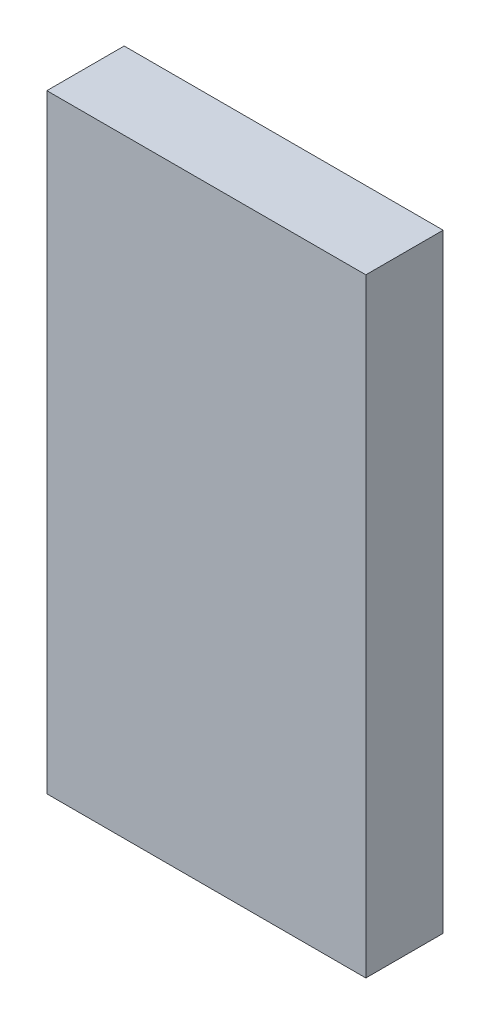
ISO-10303-21;
HEADER;
FILE_DESCRIPTION(('STEP AP214'),'2;1');
FILE_NAME('part.step','',(''),(''),'','','');
FILE_SCHEMA(('AUTOMOTIVE_DESIGN { 1 0 10303 214 1 1 1 1 }'));
ENDSEC;
DATA;
#1=APPLICATION_CONTEXT('core data for automotive mechanical design processes');
#2=APPLICATION_PROTOCOL_DEFINITION('international standard','automotive_design',2000,#1);
#3=PRODUCT_CONTEXT('',#1,'mechanical');
#4=PRODUCT('Part','Part','',(#3));
#5=PRODUCT_RELATED_PRODUCT_CATEGORY('part','',(#4));
#6=PRODUCT_DEFINITION_FORMATION('','',#4);
#7=PRODUCT_DEFINITION_CONTEXT('part definition',#1,'design');
#8=PRODUCT_DEFINITION('design','',#6,#7);
#9=PRODUCT_DEFINITION_SHAPE('','',#8);
#10=(LENGTH_UNIT() NAMED_UNIT(*) SI_UNIT(.MILLI.,.METRE.));
#11=(NAMED_UNIT(*) PLANE_ANGLE_UNIT() SI_UNIT($,.RADIAN.));
#12=(NAMED_UNIT(*) SI_UNIT($,.STERADIAN.) SOLID_ANGLE_UNIT());
#13=UNCERTAINTY_MEASURE_WITH_UNIT(LENGTH_MEASURE(1.E-05),#10,'distance_accuracy_value','');
#14=(GEOMETRIC_REPRESENTATION_CONTEXT(3) GLOBAL_UNCERTAINTY_ASSIGNED_CONTEXT((#13)) GLOBAL_UNIT_ASSIGNED_CONTEXT((#10,
#11,#12)) REPRESENTATION_CONTEXT('',''));
#15=CARTESIAN_POINT('',(0.,0.,0.));
#16=DIRECTION('',(0.,0.,1.));
#17=DIRECTION('',(1.,0.,0.));
#18=AXIS2_PLACEMENT_3D('',#15,#16,#17);
#19=CARTESIAN_POINT('',(-12.6027993894922,-13.7690277297927,1.03674100901396E-06));
#20=DIRECTION('',(0.,8.74227339409095E-08,-1.));
#21=DIRECTION('',(1.19248806384999E-08,1.,8.74227339409095E-08));
#22=AXIS2_PLACEMENT_3D('',#19,#20,#21);
#23=PLANE('',#22);
#24=DIRECTION('',(-1.19248807761764E-08,-1.,-8.74227339409095E-08));
#25=VECTOR('',#24,1.);
#26=CARTESIAN_POINT('',(-14.2527993894922,-13.7690277101167,1.03674101074869E-06));
#27=LINE('',#26,#25);
#28=CARTESIAN_POINT('',(-14.2527993519289,-10.6190277101167,1.3121226227937E-06));
#29=VERTEX_POINT('',#28);
#30=CARTESIAN_POINT('',(-14.2527994270556,-16.9190277101166,7.61359398703671E-07));
#31=VERTEX_POINT('',#30);
#32=EDGE_CURVE('E90',#29,#31,#27,.T.);
#33=ORIENTED_EDGE('',*,*,#32,.T.);
#34=DIRECTION('',(1.,-1.19248806384999E-08,0.));
#35=VECTOR('',#34,1.);
#36=CARTESIAN_POINT('',(-12.6027994270556,-16.9190277297927,7.61359396968947E-07));
#37=LINE('',#36,#35);
#38=CARTESIAN_POINT('',(-10.9527994270556,-16.9190277494687,7.61359395234224E-07));
#39=VERTEX_POINT('',#38);
#40=EDGE_CURVE('E27',#31,#39,#37,.T.);
#41=ORIENTED_EDGE('',*,*,#40,.T.);
#42=DIRECTION('',(-1.19248807761764E-08,-1.,-8.74227339409095E-08));
#43=VECTOR('',#42,1.);
#44=CARTESIAN_POINT('',(-10.9527993894922,-13.7690277494688,1.03674100727924E-06));
#45=LINE('',#44,#43);
#46=CARTESIAN_POINT('',(-10.9527993519289,-10.6190277494688,1.31212261932426E-06));
#47=VERTEX_POINT('',#46);
#48=EDGE_CURVE('E78',#47,#39,#45,.T.);
#49=ORIENTED_EDGE('',*,*,#48,.F.);
#50=DIRECTION('',(1.,-1.19248806384999E-08,0.));
#51=VECTOR('',#50,1.);
#52=CARTESIAN_POINT('',(-12.6027993519289,-10.6190277297927,1.31212262105898E-06));
#53=LINE('',#52,#51);
#54=EDGE_CURVE('E101',#29,#47,#53,.T.);
#55=ORIENTED_EDGE('',*,*,#54,.F.);
#56=EDGE_LOOP('',(#33,#41,#49,#55));
#57=FACE_BOUND('',#56,.T.);
#58=ADVANCED_FACE('F17',(#57),#23,.F.);
#59=CARTESIAN_POINT('',(-12.6027993894922,-13.7690276598545,-0.799998963258989));
#60=DIRECTION('',(0.,8.74227339409095E-08,-1.));
#61=DIRECTION('',(1.19248806384999E-08,1.,8.74227339409095E-08));
#62=AXIS2_PLACEMENT_3D('',#59,#60,#61);
#63=PLANE('',#62);
#64=DIRECTION('',(-1.19248807761764E-08,-1.,-8.74227339409095E-08));
#65=VECTOR('',#64,1.);
#66=CARTESIAN_POINT('',(-14.2527993894922,-13.7690276401785,-0.799998963258987));
#67=LINE('',#66,#65);
#68=CARTESIAN_POINT('',(-14.2527993519289,-10.6190276401785,-0.799998687877375));
#69=VERTEX_POINT('',#68);
#70=CARTESIAN_POINT('',(-14.2527994270556,-16.9190276401785,-0.799999238640599));
#71=VERTEX_POINT('',#70);
#72=EDGE_CURVE('E81',#69,#71,#67,.T.);
#73=ORIENTED_EDGE('',*,*,#72,.F.);
#74=DIRECTION('',(1.,-1.19248806384999E-08,0.));
#75=VECTOR('',#74,1.);
#76=CARTESIAN_POINT('',(-12.6027993519289,-10.6190276598545,-0.799998687877377));
#77=LINE('',#76,#75);
#78=CARTESIAN_POINT('',(-10.9527993519289,-10.6190276795306,-0.799998687877378));
#79=VERTEX_POINT('',#78);
#80=EDGE_CURVE('E67',#69,#79,#77,.T.);
#81=ORIENTED_EDGE('',*,*,#80,.T.);
#82=DIRECTION('',(-1.19248807761764E-08,-1.,-8.74227339409095E-08));
#83=VECTOR('',#82,1.);
#84=CARTESIAN_POINT('',(-10.9527993894922,-13.7690276795306,-0.799998963258991));
#85=LINE('',#84,#83);
#86=CARTESIAN_POINT('',(-10.9527994270556,-16.9190276795306,-0.799999238640603));
#87=VERTEX_POINT('',#86);
#88=EDGE_CURVE('E111',#79,#87,#85,.T.);
#89=ORIENTED_EDGE('',*,*,#88,.T.);
#90=DIRECTION('',(1.,-1.19248806384999E-08,0.));
#91=VECTOR('',#90,1.);
#92=CARTESIAN_POINT('',(-12.6027994270556,-16.9190276598545,-0.799999238640601));
#93=LINE('',#92,#91);
#94=EDGE_CURVE('E11',#71,#87,#93,.T.);
#95=ORIENTED_EDGE('',*,*,#94,.F.);
#96=EDGE_LOOP('',(#73,#81,#89,#95));
#97=FACE_BOUND('',#96,.T.);
#98=ADVANCED_FACE('F82',(#97),#63,.T.);
#99=CARTESIAN_POINT('',(-12.6027994270556,-16.9190276598545,-0.799999238640601));
#100=DIRECTION('',(-1.19248806384999E-08,-1.,-8.74227339409095E-08));
#101=DIRECTION('',(0.,8.74227339409095E-08,-1.));
#102=AXIS2_PLACEMENT_3D('',#99,#100,#101);
#103=PLANE('',#102);
#104=ORIENTED_EDGE('',*,*,#40,.F.);
#105=DIRECTION('',(0.,-8.74227339409095E-08,1.));
#106=VECTOR('',#105,1.);
#107=CARTESIAN_POINT('',(-14.2527994270556,-16.9190276401785,-0.799999238640599));
#108=LINE('',#107,#106);
#109=EDGE_CURVE('E86',#71,#31,#108,.T.);
#110=ORIENTED_EDGE('',*,*,#109,.F.);
#111=ORIENTED_EDGE('',*,*,#94,.T.);
#112=DIRECTION('',(0.,-8.74227339409095E-08,1.));
#113=VECTOR('',#112,1.);
#114=CARTESIAN_POINT('',(-10.9527994270556,-16.9190276795306,-0.799999238640603));
#115=LINE('',#114,#113);
#116=EDGE_CURVE('E108',#87,#39,#115,.T.);
#117=ORIENTED_EDGE('',*,*,#116,.T.);
#118=EDGE_LOOP('',(#104,#110,#111,#117));
#119=FACE_BOUND('',#118,.T.);
#120=ADVANCED_FACE('F140',(#119),#103,.T.);
#121=CARTESIAN_POINT('',(-10.9527993894922,-13.7690276795306,-0.799998963258991));
#122=DIRECTION('',(-1.,1.19248807761763E-08,0.));
#123=DIRECTION('',(1.19248807761764E-08,1.,8.74227339409095E-08));
#124=AXIS2_PLACEMENT_3D('',#121,#122,#123);
#125=PLANE('',#124);
#126=ORIENTED_EDGE('',*,*,#48,.T.);
#127=ORIENTED_EDGE('',*,*,#116,.F.);
#128=ORIENTED_EDGE('',*,*,#88,.F.);
#129=DIRECTION('',(0.,-8.74227339409095E-08,1.));
#130=VECTOR('',#129,1.);
#131=CARTESIAN_POINT('',(-10.9527993519289,-10.6190276795306,-0.799998687877378));
#132=LINE('',#131,#130);
#133=EDGE_CURVE('E75',#79,#47,#132,.T.);
#134=ORIENTED_EDGE('',*,*,#133,.T.);
#135=EDGE_LOOP('',(#126,#127,#128,#134));
#136=FACE_BOUND('',#135,.T.);
#137=ADVANCED_FACE('F139',(#136),#125,.F.);
#138=CARTESIAN_POINT('',(-12.6027993519289,-10.6190276598545,-0.799998687877377));
#139=DIRECTION('',(-1.19248806384999E-08,-1.,-8.74227339409095E-08));
#140=DIRECTION('',(0.,8.74227339409095E-08,-1.));
#141=AXIS2_PLACEMENT_3D('',#138,#139,#140);
#142=PLANE('',#141);
#143=ORIENTED_EDGE('',*,*,#54,.T.);
#144=ORIENTED_EDGE('',*,*,#133,.F.);
#145=ORIENTED_EDGE('',*,*,#80,.F.);
#146=DIRECTION('',(0.,-8.74227339409095E-08,1.));
#147=VECTOR('',#146,1.);
#148=CARTESIAN_POINT('',(-14.2527993519289,-10.6190276401785,-0.799998687877375));
#149=LINE('',#148,#147);
#150=EDGE_CURVE('E72',#69,#29,#149,.T.);
#151=ORIENTED_EDGE('',*,*,#150,.T.);
#152=EDGE_LOOP('',(#143,#144,#145,#151));
#153=FACE_BOUND('',#152,.T.);
#154=ADVANCED_FACE('F70',(#153),#142,.F.);
#155=CARTESIAN_POINT('',(-14.2527993894922,-13.7690276401785,-0.799998963258987));
#156=DIRECTION('',(-1.,1.19248807761763E-08,0.));
#157=DIRECTION('',(1.19248807761764E-08,1.,8.74227339409095E-08));
#158=AXIS2_PLACEMENT_3D('',#155,#156,#157);
#159=PLANE('',#158);
#160=ORIENTED_EDGE('',*,*,#32,.F.);
#161=ORIENTED_EDGE('',*,*,#150,.F.);
#162=ORIENTED_EDGE('',*,*,#72,.T.);
#163=ORIENTED_EDGE('',*,*,#109,.T.);
#164=EDGE_LOOP('',(#160,#161,#162,#163));
#165=FACE_BOUND('',#164,.T.);
#166=ADVANCED_FACE('F88',(#165),#159,.T.);
#167=CLOSED_SHELL('',(#58,#98,#120,#137,#154,#166));
#168=MANIFOLD_SOLID_BREP('B1',#167);
#169=ADVANCED_BREP_SHAPE_REPRESENTATION('',(#18,#168),#14);
#170=SHAPE_DEFINITION_REPRESENTATION(#9,#169);
ENDSEC;
END-ISO-10303-21;
